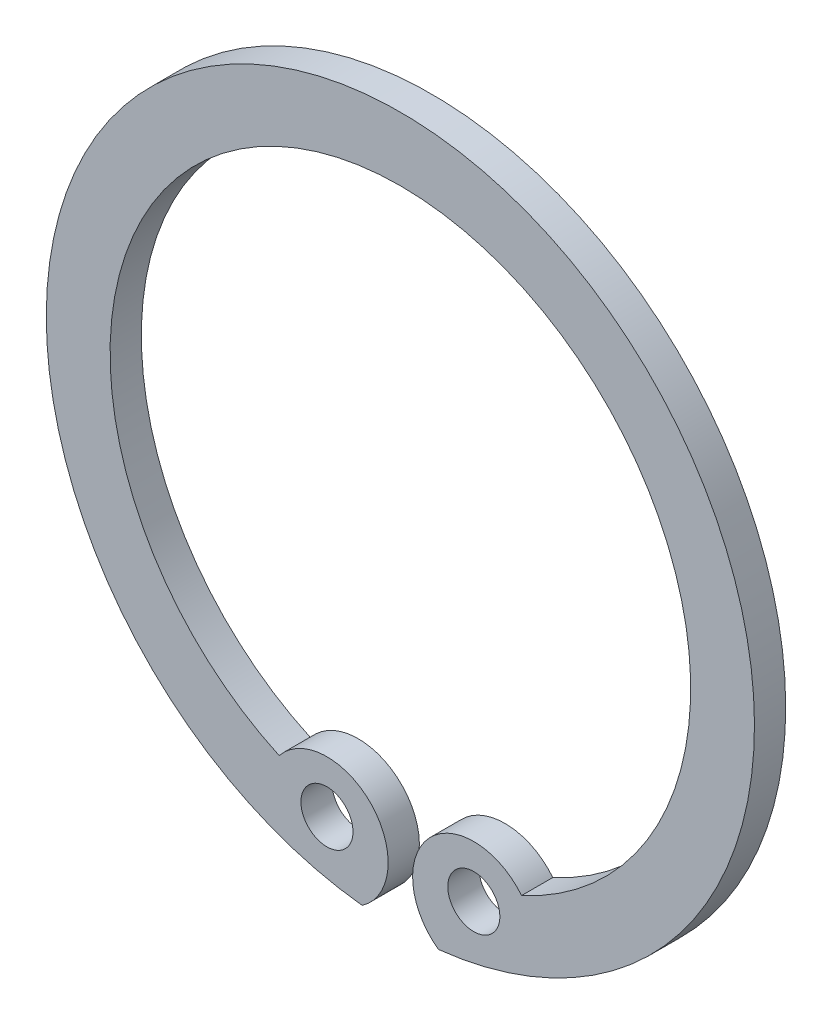
ISO-10303-21;
HEADER;
FILE_DESCRIPTION(('STEP AP214'),'2;1');
FILE_NAME('part.step','',(''),(''),'','','');
FILE_SCHEMA(('AUTOMOTIVE_DESIGN { 1 0 10303 214 1 1 1 1 }'));
ENDSEC;
DATA;
#1=APPLICATION_CONTEXT('core data for automotive mechanical design processes');
#2=APPLICATION_PROTOCOL_DEFINITION('international standard','automotive_design',2000,#1);
#3=PRODUCT_CONTEXT('',#1,'mechanical');
#4=PRODUCT('Part','Part','',(#3));
#5=PRODUCT_RELATED_PRODUCT_CATEGORY('part','',(#4));
#6=PRODUCT_DEFINITION_FORMATION('','',#4);
#7=PRODUCT_DEFINITION_CONTEXT('part definition',#1,'design');
#8=PRODUCT_DEFINITION('design','',#6,#7);
#9=PRODUCT_DEFINITION_SHAPE('','',#8);
#10=(LENGTH_UNIT() NAMED_UNIT(*) SI_UNIT(.MILLI.,.METRE.));
#11=(NAMED_UNIT(*) PLANE_ANGLE_UNIT() SI_UNIT($,.RADIAN.));
#12=(NAMED_UNIT(*) SI_UNIT($,.STERADIAN.) SOLID_ANGLE_UNIT());
#13=UNCERTAINTY_MEASURE_WITH_UNIT(LENGTH_MEASURE(1.E-05),#10,'distance_accuracy_value','');
#14=(GEOMETRIC_REPRESENTATION_CONTEXT(3) GLOBAL_UNCERTAINTY_ASSIGNED_CONTEXT((#13)) GLOBAL_UNIT_ASSIGNED_CONTEXT((#10,
#11,#12)) REPRESENTATION_CONTEXT('',''));
#15=CARTESIAN_POINT('',(0.,0.,0.));
#16=DIRECTION('',(0.,0.,1.));
#17=DIRECTION('',(1.,0.,0.));
#18=AXIS2_PLACEMENT_3D('',#15,#16,#17);
#19=CARTESIAN_POINT('',(0.,0.,1.2));
#20=DIRECTION('',(0.,0.,1.));
#21=DIRECTION('',(1.,0.,0.));
#22=AXIS2_PLACEMENT_3D('',#19,#20,#21);
#23=PLANE('',#22);
#24=CARTESIAN_POINT('',(0.,0.,1.2));
#25=DIRECTION('',(0.,0.,-1.));
#26=DIRECTION('',(1.,0.,0.));
#27=AXIS2_PLACEMENT_3D('',#24,#25,#26);
#28=CIRCLE('',#27,11.15);
#29=CARTESIAN_POINT('',(-4.65493600259842,-10.1318345235062,1.2));
#30=VERTEX_POINT('',#29);
#31=CARTESIAN_POINT('',(4.65493600259842,-10.1318345235062,1.2));
#32=VERTEX_POINT('',#31);
#33=EDGE_CURVE('E56',#30,#32,#28,.T.);
#34=ORIENTED_EDGE('',*,*,#33,.T.);
#35=CARTESIAN_POINT('',(2.82,-11.6,1.2));
#36=DIRECTION('',(0.,0.,1.));
#37=DIRECTION('',(-1.,0.,0.));
#38=AXIS2_PLACEMENT_3D('',#35,#36,#37);
#39=CIRCLE('',#38,2.35);
#40=CARTESIAN_POINT('',(1.46603833602249,-13.5207518872773,1.2));
#41=VERTEX_POINT('',#40);
#42=EDGE_CURVE('E79',#32,#41,#39,.T.);
#43=ORIENTED_EDGE('',*,*,#42,.T.);
#44=CARTESIAN_POINT('',(0.,0.,1.2));
#45=DIRECTION('',(0.,0.,-1.));
#46=DIRECTION('',(1.,0.,0.));
#47=AXIS2_PLACEMENT_3D('',#44,#45,#46);
#48=CIRCLE('',#47,13.6);
#49=CARTESIAN_POINT('',(-1.46603833602249,-13.5207518872773,1.2));
#50=VERTEX_POINT('',#49);
#51=EDGE_CURVE('E11',#50,#41,#48,.T.);
#52=ORIENTED_EDGE('',*,*,#51,.F.);
#53=CARTESIAN_POINT('',(-2.82,-11.6,1.2));
#54=DIRECTION('',(0.,0.,1.));
#55=DIRECTION('',(1.,0.,0.));
#56=AXIS2_PLACEMENT_3D('',#53,#54,#55);
#57=CIRCLE('',#56,2.35);
#58=EDGE_CURVE('E36',#50,#30,#57,.T.);
#59=ORIENTED_EDGE('',*,*,#58,.T.);
#60=EDGE_LOOP('',(#34,#43,#52,#59));
#61=FACE_BOUND('',#60,.T.);
#62=CARTESIAN_POINT('',(-2.82,-11.25,1.2));
#63=DIRECTION('',(0.,0.,-1.));
#64=DIRECTION('',(1.,0.,0.));
#65=AXIS2_PLACEMENT_3D('',#62,#63,#64);
#66=CIRCLE('',#65,1.);
#67=CARTESIAN_POINT('',(-3.82,-11.25,1.2));
#68=VERTEX_POINT('',#67);
#69=EDGE_CURVE('E89',#68,#68,#66,.T.);
#70=ORIENTED_EDGE('',*,*,#69,.T.);
#71=EDGE_LOOP('',(#70));
#72=FACE_BOUND('',#71,.T.);
#73=CARTESIAN_POINT('',(2.82,-11.25,1.2));
#74=DIRECTION('',(0.,0.,-1.));
#75=DIRECTION('',(1.,0.,0.));
#76=AXIS2_PLACEMENT_3D('',#73,#74,#75);
#77=CIRCLE('',#76,1.);
#78=CARTESIAN_POINT('',(1.82,-11.25,1.2));
#79=VERTEX_POINT('',#78);
#80=EDGE_CURVE('E85',#79,#79,#77,.T.);
#81=ORIENTED_EDGE('',*,*,#80,.T.);
#82=EDGE_LOOP('',(#81));
#83=FACE_BOUND('',#82,.T.);
#84=ADVANCED_FACE('F16',(#61,#72,#83),#23,.T.);
#85=CARTESIAN_POINT('',(0.,0.,0.6));
#86=DIRECTION('',(0.,0.,-1.));
#87=DIRECTION('',(1.,0.,0.));
#88=AXIS2_PLACEMENT_3D('',#85,#86,#87);
#89=CYLINDRICAL_SURFACE('',#88,13.6);
#90=ORIENTED_EDGE('',*,*,#51,.T.);
#91=DIRECTION('',(0.,0.,-1.));
#92=VECTOR('',#91,1.);
#93=CARTESIAN_POINT('',(1.4660383360225,-13.5207518872773,0.6));
#94=LINE('',#93,#92);
#95=CARTESIAN_POINT('',(1.46603833602249,-13.5207518872773,0.));
#96=VERTEX_POINT('',#95);
#97=EDGE_CURVE('E77',#41,#96,#94,.T.);
#98=ORIENTED_EDGE('',*,*,#97,.T.);
#99=CARTESIAN_POINT('',(0.,0.,0.));
#100=DIRECTION('',(0.,0.,1.));
#101=DIRECTION('',(-1.,0.,0.));
#102=AXIS2_PLACEMENT_3D('',#99,#100,#101);
#103=CIRCLE('',#102,13.6);
#104=CARTESIAN_POINT('',(-1.46603833602249,-13.5207518872773,0.));
#105=VERTEX_POINT('',#104);
#106=EDGE_CURVE('E50',#96,#105,#103,.T.);
#107=ORIENTED_EDGE('',*,*,#106,.T.);
#108=DIRECTION('',(0.,0.,1.));
#109=VECTOR('',#108,1.);
#110=CARTESIAN_POINT('',(-1.4660383360225,-13.5207518872773,0.6));
#111=LINE('',#110,#109);
#112=EDGE_CURVE('E24',#105,#50,#111,.T.);
#113=ORIENTED_EDGE('',*,*,#112,.T.);
#114=EDGE_LOOP('',(#90,#98,#107,#113));
#115=FACE_BOUND('',#114,.T.);
#116=ADVANCED_FACE('F75',(#115),#89,.T.);
#117=CARTESIAN_POINT('',(-2.82,-11.6,0.6));
#118=DIRECTION('',(0.,0.,-1.));
#119=DIRECTION('',(1.,0.,0.));
#120=AXIS2_PLACEMENT_3D('',#117,#118,#119);
#121=CYLINDRICAL_SURFACE('',#120,2.35);
#122=DIRECTION('',(0.,0.,-1.));
#123=VECTOR('',#122,1.);
#124=CARTESIAN_POINT('',(-4.65493600259842,-10.1318345235062,0.6));
#125=LINE('',#124,#123);
#126=CARTESIAN_POINT('',(-4.65493600259842,-10.1318345235062,0.));
#127=VERTEX_POINT('',#126);
#128=EDGE_CURVE('E87',#30,#127,#125,.T.);
#129=ORIENTED_EDGE('',*,*,#128,.F.);
#130=ORIENTED_EDGE('',*,*,#58,.F.);
#131=ORIENTED_EDGE('',*,*,#112,.F.);
#132=CARTESIAN_POINT('',(-2.82,-11.6,0.));
#133=DIRECTION('',(0.,0.,-1.));
#134=DIRECTION('',(1.,0.,0.));
#135=AXIS2_PLACEMENT_3D('',#132,#133,#134);
#136=CIRCLE('',#135,2.35);
#137=EDGE_CURVE('E67',#127,#105,#136,.T.);
#138=ORIENTED_EDGE('',*,*,#137,.F.);
#139=EDGE_LOOP('',(#129,#130,#131,#138));
#140=FACE_BOUND('',#139,.T.);
#141=ADVANCED_FACE('F66',(#140),#121,.T.);
#142=CARTESIAN_POINT('',(0.,0.,-1.2));
#143=DIRECTION('',(0.,0.,-1.));
#144=DIRECTION('',(1.,0.,0.));
#145=AXIS2_PLACEMENT_3D('',#142,#143,#144);
#146=CYLINDRICAL_SURFACE('',#145,11.15);
#147=DIRECTION('',(0.,0.,1.));
#148=VECTOR('',#147,1.);
#149=CARTESIAN_POINT('',(4.65493600259842,-10.1318345235062,0.6));
#150=LINE('',#149,#148);
#151=CARTESIAN_POINT('',(4.65493600259842,-10.1318345235062,0.));
#152=VERTEX_POINT('',#151);
#153=EDGE_CURVE('E19',#152,#32,#150,.T.);
#154=ORIENTED_EDGE('',*,*,#153,.T.);
#155=ORIENTED_EDGE('',*,*,#33,.F.);
#156=ORIENTED_EDGE('',*,*,#128,.T.);
#157=CARTESIAN_POINT('',(0.,0.,0.));
#158=DIRECTION('',(0.,0.,1.));
#159=DIRECTION('',(1.,0.,0.));
#160=AXIS2_PLACEMENT_3D('',#157,#158,#159);
#161=CIRCLE('',#160,11.15);
#162=EDGE_CURVE('E73',#152,#127,#161,.T.);
#163=ORIENTED_EDGE('',*,*,#162,.F.);
#164=EDGE_LOOP('',(#154,#155,#156,#163));
#165=FACE_BOUND('',#164,.T.);
#166=ADVANCED_FACE('F109',(#165),#146,.F.);
#167=CARTESIAN_POINT('',(0.,0.,0.));
#168=DIRECTION('',(0.,0.,-1.));
#169=DIRECTION('',(-1.,0.,0.));
#170=AXIS2_PLACEMENT_3D('',#167,#168,#169);
#171=PLANE('',#170);
#172=ORIENTED_EDGE('',*,*,#106,.F.);
#173=CARTESIAN_POINT('',(2.82,-11.6,0.));
#174=DIRECTION('',(0.,0.,-1.));
#175=DIRECTION('',(-1.,0.,0.));
#176=AXIS2_PLACEMENT_3D('',#173,#174,#175);
#177=CIRCLE('',#176,2.35);
#178=EDGE_CURVE('E103',#96,#152,#177,.T.);
#179=ORIENTED_EDGE('',*,*,#178,.T.);
#180=ORIENTED_EDGE('',*,*,#162,.T.);
#181=ORIENTED_EDGE('',*,*,#137,.T.);
#182=EDGE_LOOP('',(#172,#179,#180,#181));
#183=FACE_BOUND('',#182,.T.);
#184=CARTESIAN_POINT('',(-2.82,-11.25,0.));
#185=DIRECTION('',(0.,0.,1.));
#186=DIRECTION('',(1.,0.,0.));
#187=AXIS2_PLACEMENT_3D('',#184,#185,#186);
#188=CIRCLE('',#187,1.);
#189=CARTESIAN_POINT('',(-3.82,-11.25,0.));
#190=VERTEX_POINT('',#189);
#191=EDGE_CURVE('E91',#190,#190,#188,.T.);
#192=ORIENTED_EDGE('',*,*,#191,.T.);
#193=EDGE_LOOP('',(#192));
#194=FACE_BOUND('',#193,.T.);
#195=CARTESIAN_POINT('',(2.82,-11.25,0.));
#196=DIRECTION('',(0.,0.,1.));
#197=DIRECTION('',(1.,0.,0.));
#198=AXIS2_PLACEMENT_3D('',#195,#196,#197);
#199=CIRCLE('',#198,1.);
#200=CARTESIAN_POINT('',(1.82,-11.25,0.));
#201=VERTEX_POINT('',#200);
#202=EDGE_CURVE('E92',#201,#201,#199,.T.);
#203=ORIENTED_EDGE('',*,*,#202,.T.);
#204=EDGE_LOOP('',(#203));
#205=FACE_BOUND('',#204,.T.);
#206=ADVANCED_FACE('F71',(#183,#194,#205),#171,.T.);
#207=CARTESIAN_POINT('',(2.82,-11.6,0.6));
#208=DIRECTION('',(0.,0.,1.));
#209=DIRECTION('',(-1.,0.,0.));
#210=AXIS2_PLACEMENT_3D('',#207,#208,#209);
#211=CYLINDRICAL_SURFACE('',#210,2.35);
#212=ORIENTED_EDGE('',*,*,#153,.F.);
#213=ORIENTED_EDGE('',*,*,#178,.F.);
#214=ORIENTED_EDGE('',*,*,#97,.F.);
#215=ORIENTED_EDGE('',*,*,#42,.F.);
#216=EDGE_LOOP('',(#212,#213,#214,#215));
#217=FACE_BOUND('',#216,.T.);
#218=ADVANCED_FACE('F111',(#217),#211,.T.);
#219=CARTESIAN_POINT('',(-2.82,-11.25,0.6));
#220=DIRECTION('',(0.,0.,-1.));
#221=DIRECTION('',(1.,0.,0.));
#222=AXIS2_PLACEMENT_3D('',#219,#220,#221);
#223=CYLINDRICAL_SURFACE('',#222,1.);
#224=ORIENTED_EDGE('',*,*,#191,.F.);
#225=EDGE_LOOP('',(#224));
#226=FACE_BOUND('',#225,.T.);
#227=ORIENTED_EDGE('',*,*,#69,.F.);
#228=EDGE_LOOP('',(#227));
#229=FACE_BOUND('',#228,.T.);
#230=ADVANCED_FACE('F120',(#226,#229),#223,.F.);
#231=CARTESIAN_POINT('',(2.82,-11.25,0.6));
#232=DIRECTION('',(0.,0.,-1.));
#233=DIRECTION('',(1.,0.,0.));
#234=AXIS2_PLACEMENT_3D('',#231,#232,#233);
#235=CYLINDRICAL_SURFACE('',#234,1.);
#236=ORIENTED_EDGE('',*,*,#202,.F.);
#237=EDGE_LOOP('',(#236));
#238=FACE_BOUND('',#237,.T.);
#239=ORIENTED_EDGE('',*,*,#80,.F.);
#240=EDGE_LOOP('',(#239));
#241=FACE_BOUND('',#240,.T.);
#242=ADVANCED_FACE('F118',(#238,#241),#235,.F.);
#243=CLOSED_SHELL('',(#84,#116,#141,#166,#206,#218,#230,#242));
#244=MANIFOLD_SOLID_BREP('B1',#243);
#245=ADVANCED_BREP_SHAPE_REPRESENTATION('',(#18,#244),#14);
#246=SHAPE_DEFINITION_REPRESENTATION(#9,#245);
ENDSEC;
END-ISO-10303-21;
